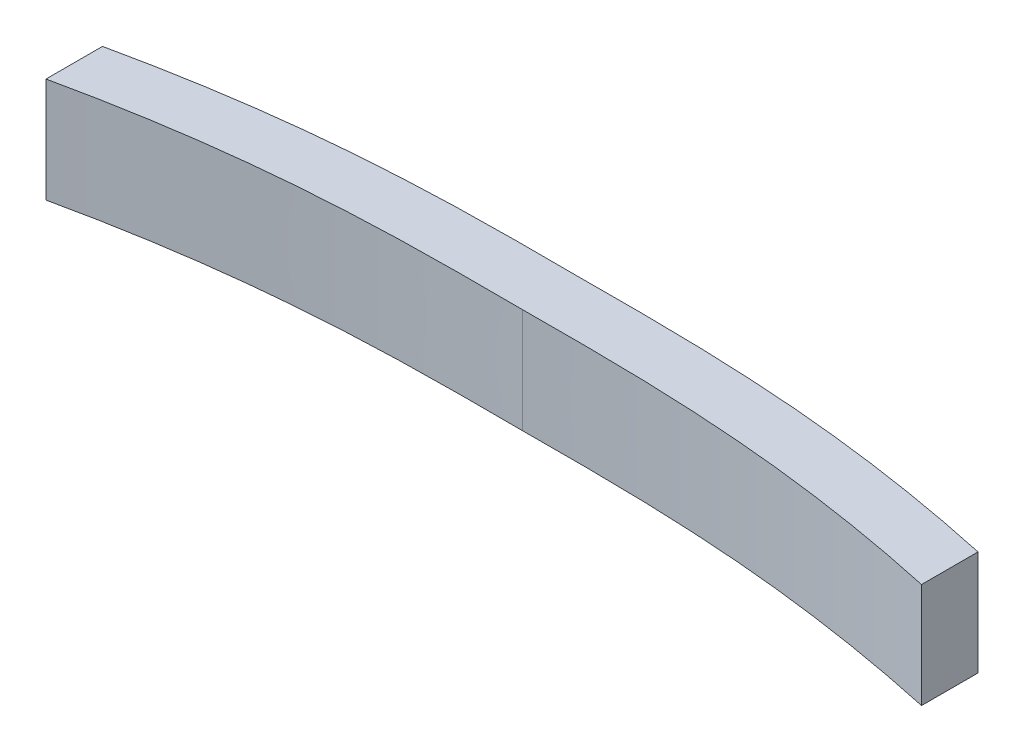
ISO-10303-21;
HEADER;
FILE_DESCRIPTION(('STEP AP214'),'2;1');
FILE_NAME('part.step','',(''),(''),'','','');
FILE_SCHEMA(('AUTOMOTIVE_DESIGN { 1 0 10303 214 1 1 1 1 }'));
ENDSEC;
DATA;
#1=APPLICATION_CONTEXT('core data for automotive mechanical design processes');
#2=APPLICATION_PROTOCOL_DEFINITION('international standard','automotive_design',2000,#1);
#3=PRODUCT_CONTEXT('',#1,'mechanical');
#4=PRODUCT('Part','Part','',(#3));
#5=PRODUCT_RELATED_PRODUCT_CATEGORY('part','',(#4));
#6=PRODUCT_DEFINITION_FORMATION('','',#4);
#7=PRODUCT_DEFINITION_CONTEXT('part definition',#1,'design');
#8=PRODUCT_DEFINITION('design','',#6,#7);
#9=PRODUCT_DEFINITION_SHAPE('','',#8);
#10=(LENGTH_UNIT() NAMED_UNIT(*) SI_UNIT(.MILLI.,.METRE.));
#11=(NAMED_UNIT(*) PLANE_ANGLE_UNIT() SI_UNIT($,.RADIAN.));
#12=(NAMED_UNIT(*) SI_UNIT($,.STERADIAN.) SOLID_ANGLE_UNIT());
#13=UNCERTAINTY_MEASURE_WITH_UNIT(LENGTH_MEASURE(1.E-05),#10,'distance_accuracy_value','');
#14=(GEOMETRIC_REPRESENTATION_CONTEXT(3) GLOBAL_UNCERTAINTY_ASSIGNED_CONTEXT((#13)) GLOBAL_UNIT_ASSIGNED_CONTEXT((#10,
#11,#12)) REPRESENTATION_CONTEXT('',''));
#15=CARTESIAN_POINT('',(0.,0.,0.));
#16=DIRECTION('',(0.,0.,1.));
#17=DIRECTION('',(1.,0.,0.));
#18=AXIS2_PLACEMENT_3D('',#15,#16,#17);
#19=CARTESIAN_POINT('',(51.8278528413148,14.,-10.0427702742712));
#20=CARTESIAN_POINT('',(43.4406782163175,14.,-11.8705340909125));
#21=CARTESIAN_POINT('',(30.144344490602,14.,-13.9378787701141));
#22=CARTESIAN_POINT('',(11.9963198104846,14.,-14.8603323521206));
#23=CARTESIAN_POINT('',(2.72279196164805,14.,-14.8449341748894));
#24=CARTESIAN_POINT('',(-2.4415138795143,14.,-14.8177026828002));
#25=B_SPLINE_CURVE_WITH_KNOTS('',3,(#19,#20,#21,#22,#23,#24),.UNSPECIFIED.,.F.,.F.,(4,1,1,4),
(0.,0.47203113006856,0.735860592725768,1.),.UNSPECIFIED.);
#26=DIRECTION('',(0.,-1.,0.));
#27=VECTOR('',#26,1.);
#28=SURFACE_OF_LINEAR_EXTRUSION('',#25,#27);
#29=DIRECTION('',(0.,-1.,0.));
#30=VECTOR('',#29,1.);
#31=CARTESIAN_POINT('',(51.8278528413149,14.,-10.0427702742712));
#32=LINE('',#31,#30);
#33=CARTESIAN_POINT('',(51.8278528413149,14.,-10.0427702742712));
#34=VERTEX_POINT('',#33);
#35=CARTESIAN_POINT('',(51.8278528413148,1.,-10.0427702742712));
#36=VERTEX_POINT('',#35);
#37=EDGE_CURVE('E144',#34,#36,#32,.T.);
#38=ORIENTED_EDGE('',*,*,#37,.T.);
#39=CARTESIAN_POINT('',(51.8278528413148,1.,-10.0427702742712));
#40=CARTESIAN_POINT('',(43.4406782163175,1.,-11.8705340909125));
#41=CARTESIAN_POINT('',(30.144344490602,1.,-13.9378787701141));
#42=CARTESIAN_POINT('',(11.9963198104846,1.,-14.8603323521206));
#43=CARTESIAN_POINT('',(2.72279196164805,1.,-14.8449341748894));
#44=CARTESIAN_POINT('',(-2.4415138795143,1.,-14.8177026828002));
#45=B_SPLINE_CURVE_WITH_KNOTS('',3,(#39,#40,#41,#42,#43,#44),.UNSPECIFIED.,.F.,.F.,(4,1,1,4),
(0.,0.47203113006856,0.735860592725768,1.),.UNSPECIFIED.);
#46=CARTESIAN_POINT('',(50.8278528414479,1.,-10.2581708982612));
#47=VERTEX_POINT('',#46);
#48=EDGE_CURVE('E127',#36,#47,#45,.T.);
#49=ORIENTED_EDGE('',*,*,#48,.T.);
#50=DIRECTION('',(0.,-1.,0.));
#51=VECTOR('',#50,1.);
#52=CARTESIAN_POINT('',(50.8278528413148,14.,-10.2581708982895));
#53=LINE('',#52,#51);
#54=CARTESIAN_POINT('',(50.8278528413148,13.,-10.258170897636));
#55=VERTEX_POINT('',#54);
#56=EDGE_CURVE('E11',#47,#55,#53,.F.);
#57=ORIENTED_EDGE('',*,*,#56,.T.);
#58=CARTESIAN_POINT('',(51.8278528413148,13.,-10.0427702742712));
#59=CARTESIAN_POINT('',(43.4406782163175,13.,-11.8705340909125));
#60=CARTESIAN_POINT('',(30.144344490602,13.,-13.9378787701141));
#61=CARTESIAN_POINT('',(11.9963198104846,13.,-14.8603323521206));
#62=CARTESIAN_POINT('',(2.72279196164805,13.,-14.8449341748894));
#63=CARTESIAN_POINT('',(-2.4415138795143,13.,-14.8177026828002));
#64=B_SPLINE_CURVE_WITH_KNOTS('',3,(#58,#59,#60,#61,#62,#63),.UNSPECIFIED.,.F.,.F.,(4,1,1,4),
(0.,0.47203113006856,0.735860592725768,1.),.UNSPECIFIED.);
#65=CARTESIAN_POINT('',(-2.44151387951431,13.,-14.8177026828002));
#66=VERTEX_POINT('',#65);
#67=EDGE_CURVE('E161',#55,#66,#64,.T.);
#68=ORIENTED_EDGE('',*,*,#67,.T.);
#69=DIRECTION('',(0.,-1.,0.));
#70=VECTOR('',#69,1.);
#71=CARTESIAN_POINT('',(-2.44151387951431,14.,-14.8177026828002));
#72=LINE('',#71,#70);
#73=CARTESIAN_POINT('',(-2.44151387951431,14.,-14.8177026828002));
#74=VERTEX_POINT('',#73);
#75=EDGE_CURVE('E140',#74,#66,#72,.T.);
#76=ORIENTED_EDGE('',*,*,#75,.F.);
#77=EDGE_CURVE('E172',#34,#74,#25,.T.);
#78=ORIENTED_EDGE('',*,*,#77,.F.);
#79=EDGE_LOOP('',(#38,#49,#57,#68,#76,#78));
#80=FACE_BOUND('',#79,.T.);
#81=ADVANCED_FACE('F36',(#80),#28,.F.);
#82=CARTESIAN_POINT('',(-56.7108806003435,14.,-10.0427702742712));
#83=CARTESIAN_POINT('',(-48.3237059753461,14.,-11.8705340909125));
#84=CARTESIAN_POINT('',(-35.0273722496307,14.,-13.9378787701141));
#85=CARTESIAN_POINT('',(-16.8793475695132,14.,-14.8603323521206));
#86=CARTESIAN_POINT('',(-7.60581972067676,14.,-14.8449341748894));
#87=CARTESIAN_POINT('',(-2.44151387951431,14.,-14.8177026828002));
#88=B_SPLINE_CURVE_WITH_KNOTS('',3,(#82,#83,#84,#85,#86,#87),.UNSPECIFIED.,.F.,.F.,(4,1,1,4),
(0.,0.47203113006856,0.735860592725768,1.),.UNSPECIFIED.);
#89=DIRECTION('',(0.,-1.,0.));
#90=VECTOR('',#89,1.);
#91=SURFACE_OF_LINEAR_EXTRUSION('',#88,#90);
#92=CARTESIAN_POINT('',(-56.7108806003435,1.,-10.0427702742712));
#93=CARTESIAN_POINT('',(-48.3237059753461,1.,-11.8705340909125));
#94=CARTESIAN_POINT('',(-35.0273722496307,1.,-13.9378787701141));
#95=CARTESIAN_POINT('',(-16.8793475695132,1.,-14.8603323521206));
#96=CARTESIAN_POINT('',(-7.60581972067676,1.,-14.8449341748894));
#97=CARTESIAN_POINT('',(-2.44151387951431,1.,-14.8177026828002));
#98=B_SPLINE_CURVE_WITH_KNOTS('',3,(#92,#93,#94,#95,#96,#97),.UNSPECIFIED.,.F.,.F.,(4,1,1,4),
(0.,0.47203113006856,0.735860592725768,1.),.UNSPECIFIED.);
#99=CARTESIAN_POINT('',(-56.7108806003435,1.,-10.0427702742712));
#100=VERTEX_POINT('',#99);
#101=CARTESIAN_POINT('',(-55.7108806003435,1.,-10.258170897636));
#102=VERTEX_POINT('',#101);
#103=EDGE_CURVE('E118',#100,#102,#98,.T.);
#104=ORIENTED_EDGE('',*,*,#103,.F.);
#105=DIRECTION('',(0.,-1.,0.));
#106=VECTOR('',#105,1.);
#107=CARTESIAN_POINT('',(-56.7108806003435,14.,-10.0427702742712));
#108=LINE('',#107,#106);
#109=CARTESIAN_POINT('',(-56.7108806003435,14.,-10.0427702742712));
#110=VERTEX_POINT('',#109);
#111=EDGE_CURVE('E133',#110,#100,#108,.T.);
#112=ORIENTED_EDGE('',*,*,#111,.F.);
#113=EDGE_CURVE('E170',#110,#74,#88,.T.);
#114=ORIENTED_EDGE('',*,*,#113,.T.);
#115=ORIENTED_EDGE('',*,*,#75,.T.);
#116=CARTESIAN_POINT('',(-56.7108806003435,13.,-10.0427702742712));
#117=CARTESIAN_POINT('',(-48.3237059753461,13.,-11.8705340909125));
#118=CARTESIAN_POINT('',(-35.0273722496307,13.,-13.9378787701141));
#119=CARTESIAN_POINT('',(-16.8793475695132,13.,-14.8603323521206));
#120=CARTESIAN_POINT('',(-7.60581972067676,13.,-14.8449341748894));
#121=CARTESIAN_POINT('',(-2.44151387951431,13.,-14.8177026828002));
#122=B_SPLINE_CURVE_WITH_KNOTS('',3,(#116,#117,#118,#119,#120,#121),.UNSPECIFIED.,.F.,.F.,(4,1,
1,4),(0.,0.47203113006856,0.735860592725768,1.),.UNSPECIFIED.);
#123=CARTESIAN_POINT('',(-55.7108806034134,13.,-10.258170897636));
#124=VERTEX_POINT('',#123);
#125=EDGE_CURVE('E152',#124,#66,#122,.T.);
#126=ORIENTED_EDGE('',*,*,#125,.F.);
#127=DIRECTION('',(0.,-1.,0.));
#128=VECTOR('',#127,1.);
#129=CARTESIAN_POINT('',(-55.7108806003435,14.,-10.2581708982895));
#130=LINE('',#129,#128);
#131=EDGE_CURVE('E44',#124,#102,#130,.T.);
#132=ORIENTED_EDGE('',*,*,#131,.T.);
#133=EDGE_LOOP('',(#104,#112,#114,#115,#126,#132));
#134=FACE_BOUND('',#133,.T.);
#135=ADVANCED_FACE('F131',(#134),#91,.T.);
#136=CARTESIAN_POINT('',(51.8278528413148,14.,2.82564835247515E-13));
#137=DIRECTION('',(-1.,0.,0.));
#138=DIRECTION('',(0.,0.,1.));
#139=AXIS2_PLACEMENT_3D('',#136,#137,#138);
#140=PLANE('',#139);
#141=DIRECTION('',(0.,-1.,0.));
#142=VECTOR('',#141,1.);
#143=CARTESIAN_POINT('',(51.8278528413148,14.,-3.04277027427121));
#144=LINE('',#143,#142);
#145=CARTESIAN_POINT('',(51.8278528413148,14.,-3.04277027427121));
#146=VERTEX_POINT('',#145);
#147=CARTESIAN_POINT('',(51.8278528413148,1.,-3.04277027427121));
#148=VERTEX_POINT('',#147);
#149=EDGE_CURVE('E59',#146,#148,#144,.T.);
#150=ORIENTED_EDGE('',*,*,#149,.T.);
#151=DIRECTION('',(0.,0.,-1.));
#152=VECTOR('',#151,1.);
#153=CARTESIAN_POINT('',(51.8278528413148,1.,2.82564835247515E-13));
#154=LINE('',#153,#152);
#155=EDGE_CURVE('E126',#148,#36,#154,.T.);
#156=ORIENTED_EDGE('',*,*,#155,.T.);
#157=ORIENTED_EDGE('',*,*,#37,.F.);
#158=DIRECTION('',(0.,0.,-1.));
#159=VECTOR('',#158,1.);
#160=CARTESIAN_POINT('',(51.8278528413148,14.,2.82564835247515E-13));
#161=LINE('',#160,#159);
#162=EDGE_CURVE('E167',#146,#34,#161,.T.);
#163=ORIENTED_EDGE('',*,*,#162,.F.);
#164=EDGE_LOOP('',(#150,#156,#157,#163));
#165=FACE_BOUND('',#164,.T.);
#166=ADVANCED_FACE('F38',(#165),#140,.F.);
#167=CARTESIAN_POINT('',(-56.7108806003434,14.,5.34050349283981E-13));
#168=DIRECTION('',(1.,0.,0.));
#169=DIRECTION('',(0.,0.,-1.));
#170=AXIS2_PLACEMENT_3D('',#167,#168,#169);
#171=PLANE('',#170);
#172=ORIENTED_EDGE('',*,*,#111,.T.);
#173=DIRECTION('',(0.,0.,1.));
#174=VECTOR('',#173,1.);
#175=CARTESIAN_POINT('',(-56.7108806003434,1.,5.34050349283981E-13));
#176=LINE('',#175,#174);
#177=CARTESIAN_POINT('',(-56.7108806003434,1.,-3.04277027427121));
#178=VERTEX_POINT('',#177);
#179=EDGE_CURVE('E115',#100,#178,#176,.T.);
#180=ORIENTED_EDGE('',*,*,#179,.T.);
#181=DIRECTION('',(0.,-1.,0.));
#182=VECTOR('',#181,1.);
#183=CARTESIAN_POINT('',(-56.7108806003434,14.,-3.04277027427121));
#184=LINE('',#183,#182);
#185=CARTESIAN_POINT('',(-56.7108806003434,14.,-3.04277027427121));
#186=VERTEX_POINT('',#185);
#187=EDGE_CURVE('E141',#186,#178,#184,.T.);
#188=ORIENTED_EDGE('',*,*,#187,.F.);
#189=DIRECTION('',(0.,0.,1.));
#190=VECTOR('',#189,1.);
#191=CARTESIAN_POINT('',(-56.7108806003434,14.,5.34050349283981E-13));
#192=LINE('',#191,#190);
#193=EDGE_CURVE('E138',#110,#186,#192,.T.);
#194=ORIENTED_EDGE('',*,*,#193,.F.);
#195=EDGE_LOOP('',(#172,#180,#188,#194));
#196=FACE_BOUND('',#195,.T.);
#197=ADVANCED_FACE('F137',(#196),#171,.F.);
#198=CARTESIAN_POINT('',(-56.7108806003434,14.,-3.04277027427121));
#199=CARTESIAN_POINT('',(-48.323705975346,14.,-4.87053409091255));
#200=CARTESIAN_POINT('',(-35.0273722496306,14.,-6.93787877011409));
#201=CARTESIAN_POINT('',(-16.8793475695131,14.,-7.86033235212055));
#202=CARTESIAN_POINT('',(-7.60581972067668,14.,-7.84493417488936));
#203=CARTESIAN_POINT('',(-2.44151387951424,14.,-7.81770268280025));
#204=B_SPLINE_CURVE_WITH_KNOTS('',3,(#198,#199,#200,#201,#202,#203),.UNSPECIFIED.,.F.,.F.,(4,1,
1,4),(0.,0.47203113006856,0.735860592725768,1.),.UNSPECIFIED.);
#205=DIRECTION('',(0.,-1.,0.));
#206=VECTOR('',#205,1.);
#207=SURFACE_OF_LINEAR_EXTRUSION('',#204,#206);
#208=ORIENTED_EDGE('',*,*,#187,.T.);
#209=CARTESIAN_POINT('',(-56.7108806003434,1.,-3.04277027427121));
#210=CARTESIAN_POINT('',(-48.323705975346,1.,-4.87053409091255));
#211=CARTESIAN_POINT('',(-35.0273722496306,1.,-6.93787877011409));
#212=CARTESIAN_POINT('',(-16.8793475695131,1.,-7.86033235212055));
#213=CARTESIAN_POINT('',(-7.60581972067668,1.,-7.84493417488936));
#214=CARTESIAN_POINT('',(-2.44151387951424,1.,-7.81770268280025));
#215=B_SPLINE_CURVE_WITH_KNOTS('',3,(#209,#210,#211,#212,#213,#214),.UNSPECIFIED.,.F.,.F.,(4,1,
1,4),(0.,0.47203113006856,0.735860592725768,1.),.UNSPECIFIED.);
#216=CARTESIAN_POINT('',(-2.44151387951423,1.,-7.81770268280025));
#217=VERTEX_POINT('',#216);
#218=EDGE_CURVE('E121',#178,#217,#215,.T.);
#219=ORIENTED_EDGE('',*,*,#218,.T.);
#220=DIRECTION('',(0.,-1.,0.));
#221=VECTOR('',#220,1.);
#222=CARTESIAN_POINT('',(-2.44151387951424,14.,-7.81770268280025));
#223=LINE('',#222,#221);
#224=CARTESIAN_POINT('',(-2.44151387951424,14.,-7.81770268280025));
#225=VERTEX_POINT('',#224);
#226=EDGE_CURVE('E146',#225,#217,#223,.T.);
#227=ORIENTED_EDGE('',*,*,#226,.F.);
#228=EDGE_CURVE('E174',#186,#225,#204,.T.);
#229=ORIENTED_EDGE('',*,*,#228,.F.);
#230=EDGE_LOOP('',(#208,#219,#227,#229));
#231=FACE_BOUND('',#230,.T.);
#232=ADVANCED_FACE('F212',(#231),#207,.F.);
#233=CARTESIAN_POINT('',(51.827852841315,14.,-3.04277027427121));
#234=CARTESIAN_POINT('',(43.4406782163176,14.,-4.87053409091255));
#235=CARTESIAN_POINT('',(30.1443444906021,14.,-6.93787877011409));
#236=CARTESIAN_POINT('',(11.9963198104847,14.,-7.86033235212055));
#237=CARTESIAN_POINT('',(2.72279196164812,14.,-7.84493417488937));
#238=CARTESIAN_POINT('',(-2.44151387951423,14.,-7.81770268280025));
#239=B_SPLINE_CURVE_WITH_KNOTS('',3,(#233,#234,#235,#236,#237,#238),.UNSPECIFIED.,.F.,.F.,(4,1,
1,4),(0.,0.47203113006856,0.735860592725768,1.),.UNSPECIFIED.);
#240=DIRECTION('',(0.,-1.,0.));
#241=VECTOR('',#240,1.);
#242=SURFACE_OF_LINEAR_EXTRUSION('',#239,#241);
#243=CARTESIAN_POINT('',(51.827852841315,1.,-3.04277027427121));
#244=CARTESIAN_POINT('',(43.4406782163176,1.,-4.87053409091255));
#245=CARTESIAN_POINT('',(30.1443444906021,1.,-6.93787877011409));
#246=CARTESIAN_POINT('',(11.9963198104847,1.,-7.86033235212055));
#247=CARTESIAN_POINT('',(2.72279196164812,1.,-7.84493417488937));
#248=CARTESIAN_POINT('',(-2.44151387951423,1.,-7.81770268280025));
#249=B_SPLINE_CURVE_WITH_KNOTS('',3,(#243,#244,#245,#246,#247,#248),.UNSPECIFIED.,.F.,.F.,(4,1,
1,4),(0.,0.47203113006856,0.735860592725768,1.),.UNSPECIFIED.);
#250=EDGE_CURVE('E359',#148,#217,#249,.T.);
#251=ORIENTED_EDGE('',*,*,#250,.F.);
#252=ORIENTED_EDGE('',*,*,#149,.F.);
#253=EDGE_CURVE('E348',#146,#225,#239,.T.);
#254=ORIENTED_EDGE('',*,*,#253,.T.);
#255=ORIENTED_EDGE('',*,*,#226,.T.);
#256=EDGE_LOOP('',(#251,#252,#254,#255));
#257=FACE_BOUND('',#256,.T.);
#258=ADVANCED_FACE('F218',(#257),#242,.T.);
#259=CARTESIAN_POINT('',(0.,14.,0.));
#260=DIRECTION('',(0.,1.,0.));
#261=DIRECTION('',(0.,0.,1.));
#262=AXIS2_PLACEMENT_3D('',#259,#260,#261);
#263=PLANE('',#262);
#264=ORIENTED_EDGE('',*,*,#162,.T.);
#265=ORIENTED_EDGE('',*,*,#77,.T.);
#266=ORIENTED_EDGE('',*,*,#113,.F.);
#267=ORIENTED_EDGE('',*,*,#193,.T.);
#268=ORIENTED_EDGE('',*,*,#228,.T.);
#269=ORIENTED_EDGE('',*,*,#253,.F.);
#270=EDGE_LOOP('',(#264,#265,#266,#267,#268,#269));
#271=FACE_BOUND('',#270,.T.);
#272=ADVANCED_FACE('F225',(#271),#263,.T.);
#273=CARTESIAN_POINT('',(50.8278528413148,1.,0.));
#274=DIRECTION('',(1.,0.,0.));
#275=DIRECTION('',(0.,0.,-1.));
#276=AXIS2_PLACEMENT_3D('',#273,#274,#275);
#277=PLANE('',#276);
#278=DIRECTION('',(0.,0.,-1.));
#279=VECTOR('',#278,1.);
#280=CARTESIAN_POINT('',(50.8278528413148,1.,0.));
#281=LINE('',#280,#279);
#282=CARTESIAN_POINT('',(50.8278528413149,1.,-4.25809168448134));
#283=VERTEX_POINT('',#282);
#284=EDGE_CURVE('E335',#283,#47,#281,.T.);
#285=ORIENTED_EDGE('',*,*,#284,.F.);
#286=DIRECTION('',(0.,1.,0.));
#287=VECTOR('',#286,1.);
#288=CARTESIAN_POINT('',(50.8278528413148,1.,-4.25809168448134));
#289=LINE('',#288,#287);
#290=CARTESIAN_POINT('',(50.8278528413148,13.,-4.25809168448134));
#291=VERTEX_POINT('',#290);
#292=EDGE_CURVE('E168',#283,#291,#289,.T.);
#293=ORIENTED_EDGE('',*,*,#292,.T.);
#294=DIRECTION('',(0.,0.,-1.));
#295=VECTOR('',#294,1.);
#296=CARTESIAN_POINT('',(50.8278528413148,13.,0.));
#297=LINE('',#296,#295);
#298=EDGE_CURVE('E324',#291,#55,#297,.T.);
#299=ORIENTED_EDGE('',*,*,#298,.T.);
#300=ORIENTED_EDGE('',*,*,#56,.F.);
#301=EDGE_LOOP('',(#285,#293,#299,#300));
#302=FACE_BOUND('',#301,.T.);
#303=ADVANCED_FACE('F233',(#302),#277,.F.);
#304=CARTESIAN_POINT('',(0.,13.,0.));
#305=DIRECTION('',(0.,1.,0.));
#306=DIRECTION('',(0.,0.,1.));
#307=AXIS2_PLACEMENT_3D('',#304,#305,#306);
#308=PLANE('',#307);
#309=ORIENTED_EDGE('',*,*,#298,.F.);
#310=CARTESIAN_POINT('',(-56.7108806003434,13.,-4.04277027427121));
#311=CARTESIAN_POINT('',(-51.0152638595637,13.,-5.28338749971168));
#312=CARTESIAN_POINT('',(-42.2215274908545,13.,-6.82612734360645));
#313=CARTESIAN_POINT('',(-30.4782510758472,13.,-8.08618104991566));
#314=CARTESIAN_POINT('',(-21.96075596933,13.,-8.60603916198291));
#315=CARTESIAN_POINT('',(-12.6802550836417,13.,-8.86610266204739));
#316=CARTESIAN_POINT('',(-2.48825539649041,13.,-8.78881620086226));
#317=CARTESIAN_POINT('',(7.83960120773846,13.,-8.866738732467));
#318=CARTESIAN_POINT('',(17.1432043535184,13.,-8.60459013100208));
#319=CARTESIAN_POINT('',(25.5946669040185,13.,-8.0816954915766));
#320=CARTESIAN_POINT('',(37.2496420777411,13.,-6.83921116778533));
#321=CARTESIAN_POINT('',(46.0225393831475,13.,-5.30731709508663));
#322=CARTESIAN_POINT('',(51.827852841315,13.,-4.04277027427121));
#323=B_SPLINE_CURVE_WITH_KNOTS('',3,(#310,#311,#312,#313,#314,#315,#316,#317,#318,#319,#320,
#321,#322),.UNSPECIFIED.,.F.,.F.,(4,1,1,1,1,1,1,1,1,1,4),(0.,0.160113822027446,0.24501196644569,
0.324303490281267,0.394459253627526,0.499999871236472,0.604256140418702,0.678146052397053,
0.755618705086474,0.836798939280944,1.),.UNSPECIFIED.);
#324=CARTESIAN_POINT('',(-55.7108806003435,13.,-4.2580866227067));
#325=VERTEX_POINT('',#324);
#326=EDGE_CURVE('E330',#325,#291,#323,.T.);
#327=ORIENTED_EDGE('',*,*,#326,.F.);
#328=DIRECTION('',(0.,0.,-1.));
#329=VECTOR('',#328,1.);
#330=CARTESIAN_POINT('',(-55.7108806003435,13.,0.));
#331=LINE('',#330,#329);
#332=EDGE_CURVE('E51',#325,#124,#331,.T.);
#333=ORIENTED_EDGE('',*,*,#332,.T.);
#334=ORIENTED_EDGE('',*,*,#125,.T.);
#335=ORIENTED_EDGE('',*,*,#67,.F.);
#336=EDGE_LOOP('',(#309,#327,#333,#334,#335));
#337=FACE_BOUND('',#336,.T.);
#338=ADVANCED_FACE('F160',(#337),#308,.F.);
#339=CARTESIAN_POINT('',(-56.7108806003434,1.,-4.04277027427121));
#340=CARTESIAN_POINT('',(-51.0152638595637,1.,-5.28338749971168));
#341=CARTESIAN_POINT('',(-42.2215274908545,1.,-6.82612734360645));
#342=CARTESIAN_POINT('',(-30.4782510758472,1.,-8.08618104991566));
#343=CARTESIAN_POINT('',(-21.96075596933,1.,-8.60603916198291));
#344=CARTESIAN_POINT('',(-12.6802550836417,1.,-8.86610266204739));
#345=CARTESIAN_POINT('',(-2.48825539649041,1.,-8.78881620086226));
#346=CARTESIAN_POINT('',(7.83960120773846,1.,-8.866738732467));
#347=CARTESIAN_POINT('',(17.1432043535184,1.,-8.60459013100208));
#348=CARTESIAN_POINT('',(25.5946669040185,1.,-8.0816954915766));
#349=CARTESIAN_POINT('',(37.2496420777411,1.,-6.83921116778533));
#350=CARTESIAN_POINT('',(46.0225393831475,1.,-5.30731709508663));
#351=CARTESIAN_POINT('',(51.827852841315,1.,-4.04277027427121));
#352=B_SPLINE_CURVE_WITH_KNOTS('',3,(#339,#340,#341,#342,#343,#344,#345,#346,#347,#348,#349,
#350,#351),.UNSPECIFIED.,.F.,.F.,(4,1,1,1,1,1,1,1,1,1,4),(0.,0.160113822027446,0.24501196644569,
0.324303490281267,0.394459253627526,0.499999871236472,0.604256140418702,0.678146052397053,
0.755618705086474,0.836798939280944,1.),.UNSPECIFIED.);
#353=DIRECTION('',(0.,1.,0.));
#354=VECTOR('',#353,1.);
#355=SURFACE_OF_LINEAR_EXTRUSION('',#352,#354);
#356=ORIENTED_EDGE('',*,*,#326,.T.);
#357=ORIENTED_EDGE('',*,*,#292,.F.);
#358=CARTESIAN_POINT('',(-55.7108806003435,1.,-4.2580866227067));
#359=VERTEX_POINT('',#358);
#360=EDGE_CURVE('E315',#359,#283,#352,.T.);
#361=ORIENTED_EDGE('',*,*,#360,.F.);
#362=DIRECTION('',(0.,1.,0.));
#363=VECTOR('',#362,1.);
#364=CARTESIAN_POINT('',(-55.7108806003435,1.,-4.2580866227067));
#365=LINE('',#364,#363);
#366=EDGE_CURVE('E321',#359,#325,#365,.T.);
#367=ORIENTED_EDGE('',*,*,#366,.T.);
#368=EDGE_LOOP('',(#356,#357,#361,#367));
#369=FACE_BOUND('',#368,.T.);
#370=ADVANCED_FACE('F246',(#369),#355,.F.);
#371=CARTESIAN_POINT('',(-55.7108806003435,1.,0.));
#372=DIRECTION('',(1.,0.,0.));
#373=DIRECTION('',(0.,0.,-1.));
#374=AXIS2_PLACEMENT_3D('',#371,#372,#373);
#375=PLANE('',#374);
#376=ORIENTED_EDGE('',*,*,#332,.F.);
#377=ORIENTED_EDGE('',*,*,#366,.F.);
#378=DIRECTION('',(0.,0.,-1.));
#379=VECTOR('',#378,1.);
#380=CARTESIAN_POINT('',(-55.7108806003435,1.,0.));
#381=LINE('',#380,#379);
#382=EDGE_CURVE('E322',#359,#102,#381,.T.);
#383=ORIENTED_EDGE('',*,*,#382,.T.);
#384=ORIENTED_EDGE('',*,*,#131,.F.);
#385=EDGE_LOOP('',(#376,#377,#383,#384));
#386=FACE_BOUND('',#385,.T.);
#387=ADVANCED_FACE('F252',(#386),#375,.T.);
#388=CARTESIAN_POINT('',(-59.3897351930366,1.,-14.8603323521206));
#389=DIRECTION('',(0.,1.,0.));
#390=DIRECTION('',(0.,0.,1.));
#391=AXIS2_PLACEMENT_3D('',#388,#389,#390);
#392=PLANE('',#391);
#393=ORIENTED_EDGE('',*,*,#48,.F.);
#394=ORIENTED_EDGE('',*,*,#155,.F.);
#395=ORIENTED_EDGE('',*,*,#250,.T.);
#396=ORIENTED_EDGE('',*,*,#218,.F.);
#397=ORIENTED_EDGE('',*,*,#179,.F.);
#398=ORIENTED_EDGE('',*,*,#103,.T.);
#399=ORIENTED_EDGE('',*,*,#382,.F.);
#400=ORIENTED_EDGE('',*,*,#360,.T.);
#401=ORIENTED_EDGE('',*,*,#284,.T.);
#402=EDGE_LOOP('',(#393,#394,#395,#396,#397,#398,#399,#400,#401));
#403=FACE_BOUND('',#402,.T.);
#404=ADVANCED_FACE('F117',(#403),#392,.F.);
#405=CLOSED_SHELL('',(#81,#135,#166,#197,#232,#258,#272,#303,#338,#370,#387,#404));
#406=MANIFOLD_SOLID_BREP('B2',#405);
#407=ADVANCED_BREP_SHAPE_REPRESENTATION('',(#18,#406),#14);
#408=SHAPE_DEFINITION_REPRESENTATION(#9,#407);
ENDSEC;
END-ISO-10303-21;
